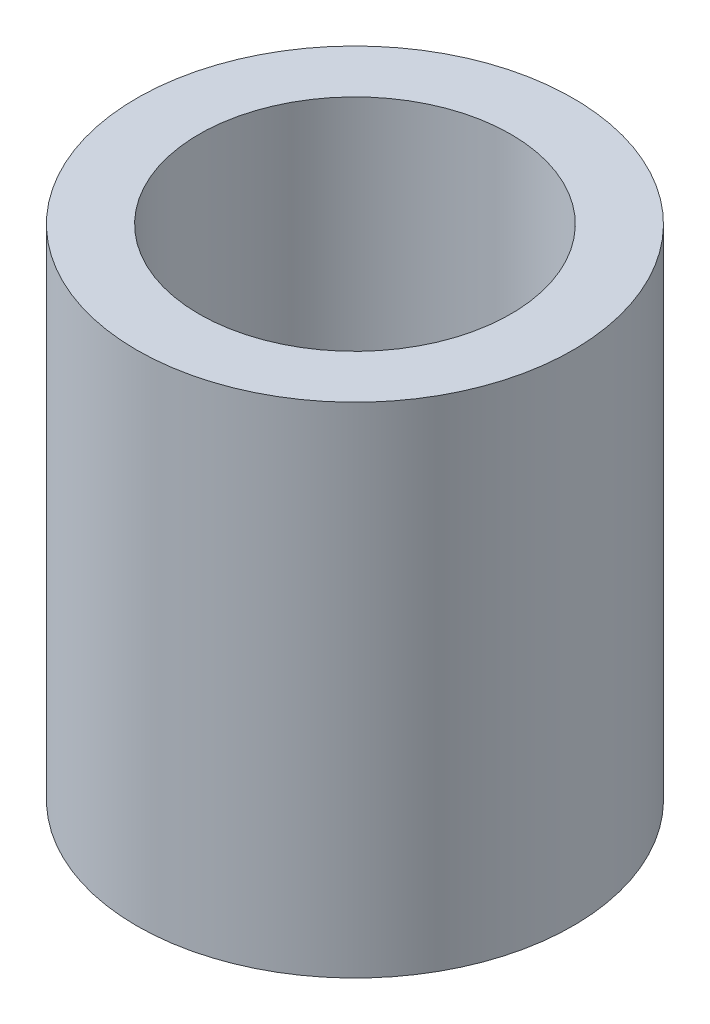
ISO-10303-21;
HEADER;
FILE_DESCRIPTION(('STEP AP214'),'2;1');
FILE_NAME('part.step','',(''),(''),'','','');
FILE_SCHEMA(('AUTOMOTIVE_DESIGN { 1 0 10303 214 1 1 1 1 }'));
ENDSEC;
DATA;
#1=APPLICATION_CONTEXT('core data for automotive mechanical design processes');
#2=APPLICATION_PROTOCOL_DEFINITION('international standard','automotive_design',2000,#1);
#3=PRODUCT_CONTEXT('',#1,'mechanical');
#4=PRODUCT('Part','Part','',(#3));
#5=PRODUCT_RELATED_PRODUCT_CATEGORY('part','',(#4));
#6=PRODUCT_DEFINITION_FORMATION('','',#4);
#7=PRODUCT_DEFINITION_CONTEXT('part definition',#1,'design');
#8=PRODUCT_DEFINITION('design','',#6,#7);
#9=PRODUCT_DEFINITION_SHAPE('','',#8);
#10=(LENGTH_UNIT() NAMED_UNIT(*) SI_UNIT(.MILLI.,.METRE.));
#11=(NAMED_UNIT(*) PLANE_ANGLE_UNIT() SI_UNIT($,.RADIAN.));
#12=(NAMED_UNIT(*) SI_UNIT($,.STERADIAN.) SOLID_ANGLE_UNIT());
#13=UNCERTAINTY_MEASURE_WITH_UNIT(LENGTH_MEASURE(1.E-05),#10,'distance_accuracy_value','');
#14=(GEOMETRIC_REPRESENTATION_CONTEXT(3) GLOBAL_UNCERTAINTY_ASSIGNED_CONTEXT((#13)) GLOBAL_UNIT_ASSIGNED_CONTEXT((#10,
#11,#12)) REPRESENTATION_CONTEXT('',''));
#15=CARTESIAN_POINT('',(0.,0.,0.));
#16=DIRECTION('',(0.,0.,1.));
#17=DIRECTION('',(1.,0.,0.));
#18=AXIS2_PLACEMENT_3D('',#15,#16,#17);
#19=CARTESIAN_POINT('',(0.,25.4,0.));
#20=DIRECTION('',(0.,1.,0.));
#21=DIRECTION('',(0.,0.,1.));
#22=AXIS2_PLACEMENT_3D('',#19,#20,#21);
#23=PLANE('',#22);
#24=CARTESIAN_POINT('',(0.,25.4,0.));
#25=DIRECTION('',(0.,1.,0.));
#26=DIRECTION('',(0.,0.,1.));
#27=AXIS2_PLACEMENT_3D('',#24,#25,#26);
#28=CIRCLE('',#27,11.1125);
#29=CARTESIAN_POINT('',(0.,25.4,11.1125));
#30=VERTEX_POINT('',#29);
#31=EDGE_CURVE('E10',#30,#30,#28,.T.);
#32=ORIENTED_EDGE('',*,*,#31,.T.);
#33=EDGE_LOOP('',(#32));
#34=FACE_BOUND('',#33,.T.);
#35=CARTESIAN_POINT('',(0.,25.4,0.));
#36=DIRECTION('',(0.,1.,0.));
#37=DIRECTION('',(0.,0.,1.));
#38=AXIS2_PLACEMENT_3D('',#35,#36,#37);
#39=CIRCLE('',#38,7.9375);
#40=CARTESIAN_POINT('',(0.,25.4,7.9375));
#41=VERTEX_POINT('',#40);
#42=EDGE_CURVE('E55',#41,#41,#39,.T.);
#43=ORIENTED_EDGE('',*,*,#42,.F.);
#44=EDGE_LOOP('',(#43));
#45=FACE_BOUND('',#44,.T.);
#46=ADVANCED_FACE('F40',(#34,#45),#23,.T.);
#47=CARTESIAN_POINT('',(0.,0.,0.));
#48=DIRECTION('',(0.,1.,0.));
#49=DIRECTION('',(0.,0.,1.));
#50=AXIS2_PLACEMENT_3D('',#47,#48,#49);
#51=PLANE('',#50);
#52=CARTESIAN_POINT('',(0.,0.,0.));
#53=DIRECTION('',(0.,1.,0.));
#54=DIRECTION('',(0.,0.,1.));
#55=AXIS2_PLACEMENT_3D('',#52,#53,#54);
#56=CIRCLE('',#55,11.1125);
#57=CARTESIAN_POINT('',(0.,0.,11.1125));
#58=VERTEX_POINT('',#57);
#59=EDGE_CURVE('E44',#58,#58,#56,.T.);
#60=ORIENTED_EDGE('',*,*,#59,.F.);
#61=EDGE_LOOP('',(#60));
#62=FACE_BOUND('',#61,.T.);
#63=CARTESIAN_POINT('',(0.,0.,0.));
#64=DIRECTION('',(0.,1.,0.));
#65=DIRECTION('',(0.,0.,1.));
#66=AXIS2_PLACEMENT_3D('',#63,#64,#65);
#67=CIRCLE('',#66,7.9375);
#68=CARTESIAN_POINT('',(0.,0.,7.9375));
#69=VERTEX_POINT('',#68);
#70=EDGE_CURVE('E57',#69,#69,#67,.T.);
#71=ORIENTED_EDGE('',*,*,#70,.T.);
#72=EDGE_LOOP('',(#71));
#73=FACE_BOUND('',#72,.T.);
#74=ADVANCED_FACE('F69',(#62,#73),#51,.F.);
#75=CARTESIAN_POINT('',(0.,25.4,0.));
#76=DIRECTION('',(0.,-1.,0.));
#77=DIRECTION('',(0.,0.,-1.));
#78=AXIS2_PLACEMENT_3D('',#75,#76,#77);
#79=CYLINDRICAL_SURFACE('',#78,11.1125);
#80=ORIENTED_EDGE('',*,*,#31,.F.);
#81=EDGE_LOOP('',(#80));
#82=FACE_BOUND('',#81,.T.);
#83=ORIENTED_EDGE('',*,*,#59,.T.);
#84=EDGE_LOOP('',(#83));
#85=FACE_BOUND('',#84,.T.);
#86=ADVANCED_FACE('F42',(#82,#85),#79,.T.);
#87=CARTESIAN_POINT('',(0.,25.4,0.));
#88=DIRECTION('',(0.,-1.,0.));
#89=DIRECTION('',(0.,0.,-1.));
#90=AXIS2_PLACEMENT_3D('',#87,#88,#89);
#91=CYLINDRICAL_SURFACE('',#90,7.9375);
#92=ORIENTED_EDGE('',*,*,#42,.T.);
#93=EDGE_LOOP('',(#92));
#94=FACE_BOUND('',#93,.T.);
#95=ORIENTED_EDGE('',*,*,#70,.F.);
#96=EDGE_LOOP('',(#95));
#97=FACE_BOUND('',#96,.T.);
#98=ADVANCED_FACE('F65',(#94,#97),#91,.F.);
#99=CLOSED_SHELL('',(#46,#74,#86,#98));
#100=MANIFOLD_SOLID_BREP('B2',#99);
#101=ADVANCED_BREP_SHAPE_REPRESENTATION('',(#18,#100),#14);
#102=SHAPE_DEFINITION_REPRESENTATION(#9,#101);
ENDSEC;
END-ISO-10303-21;
